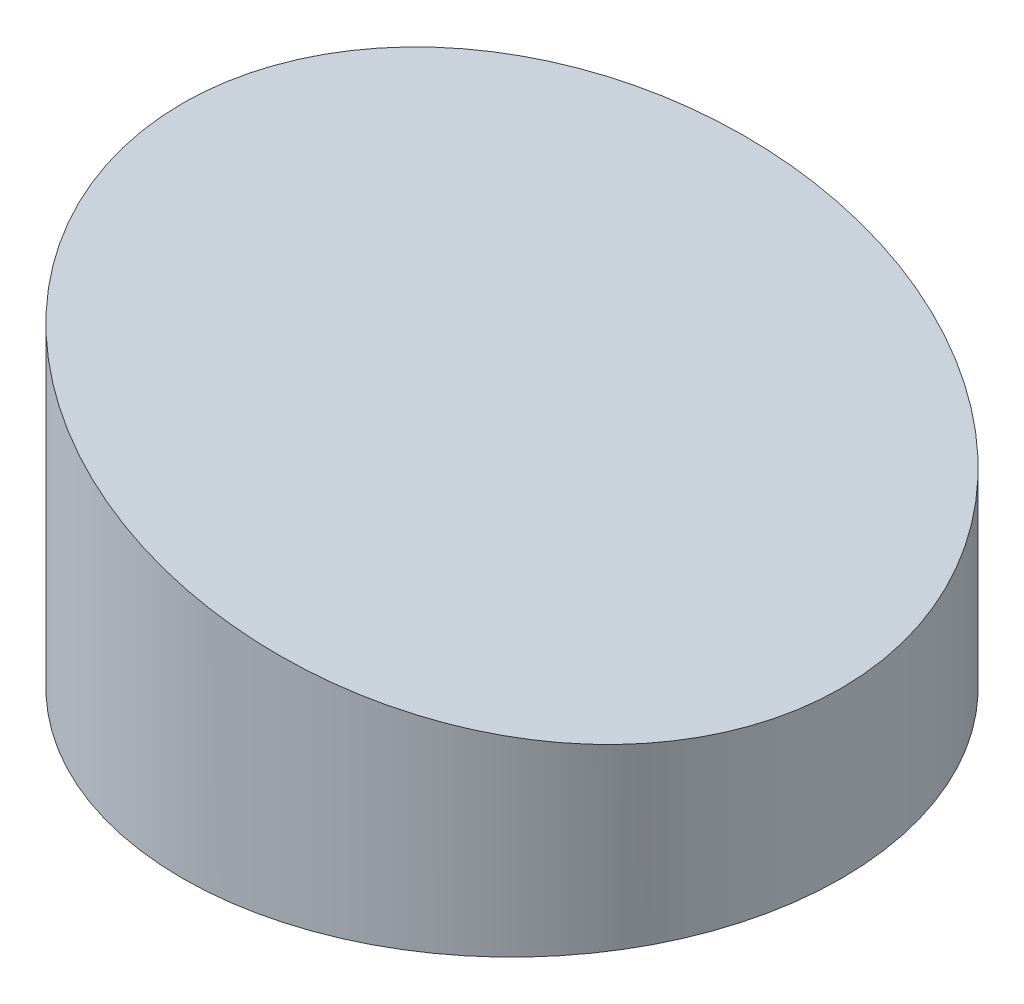
ISO-10303-21;
HEADER;
FILE_DESCRIPTION(('STEP AP214'),'2;1');
FILE_NAME('part.step','',(''),(''),'','','');
FILE_SCHEMA(('AUTOMOTIVE_DESIGN { 1 0 10303 214 1 1 1 1 }'));
ENDSEC;
DATA;
#1=APPLICATION_CONTEXT('core data for automotive mechanical design processes');
#2=APPLICATION_PROTOCOL_DEFINITION('international standard','automotive_design',2000,#1);
#3=PRODUCT_CONTEXT('',#1,'mechanical');
#4=PRODUCT('Part','Part','',(#3));
#5=PRODUCT_RELATED_PRODUCT_CATEGORY('part','',(#4));
#6=PRODUCT_DEFINITION_FORMATION('','',#4);
#7=PRODUCT_DEFINITION_CONTEXT('part definition',#1,'design');
#8=PRODUCT_DEFINITION('design','',#6,#7);
#9=PRODUCT_DEFINITION_SHAPE('','',#8);
#10=(LENGTH_UNIT() NAMED_UNIT(*) SI_UNIT(.MILLI.,.METRE.));
#11=(NAMED_UNIT(*) PLANE_ANGLE_UNIT() SI_UNIT($,.RADIAN.));
#12=(NAMED_UNIT(*) SI_UNIT($,.STERADIAN.) SOLID_ANGLE_UNIT());
#13=UNCERTAINTY_MEASURE_WITH_UNIT(LENGTH_MEASURE(1.E-05),#10,'distance_accuracy_value','');
#14=(GEOMETRIC_REPRESENTATION_CONTEXT(3) GLOBAL_UNCERTAINTY_ASSIGNED_CONTEXT((#13)) GLOBAL_UNIT_ASSIGNED_CONTEXT((#10,
#11,#12)) REPRESENTATION_CONTEXT('',''));
#15=CARTESIAN_POINT('',(0.,0.,0.));
#16=DIRECTION('',(0.,0.,1.));
#17=DIRECTION('',(1.,0.,0.));
#18=AXIS2_PLACEMENT_3D('',#15,#16,#17);
#19=CARTESIAN_POINT('',(0.,13.16,0.));
#20=DIRECTION('',(0.,-1.,0.));
#21=DIRECTION('',(0.,0.,-1.));
#22=AXIS2_PLACEMENT_3D('',#19,#20,#21);
#23=CYLINDRICAL_SURFACE('',#22,12.7);
#24=CARTESIAN_POINT('',(0.,0.,0.));
#25=DIRECTION('',(0.,1.,0.));
#26=DIRECTION('',(0.,0.,1.));
#27=AXIS2_PLACEMENT_3D('',#24,#25,#26);
#28=CIRCLE('',#27,12.7);
#29=CARTESIAN_POINT('',(0.,0.,12.7));
#30=VERTEX_POINT('',#29);
#31=EDGE_CURVE('E10',#30,#30,#28,.T.);
#32=ORIENTED_EDGE('',*,*,#31,.T.);
#33=EDGE_LOOP('',(#32));
#34=FACE_BOUND('',#33,.T.);
#35=CARTESIAN_POINT('',(0.,9.755,0.));
#36=DIRECTION('',(0.258964172391732,0.965886927863435,0.));
#37=DIRECTION('',(0.965886927863435,-0.258964172391732,0.));
#38=AXIS2_PLACEMENT_3D('',#35,#36,#37);
#39=ELLIPSE('',#38,13.1485369908595,12.7);
#40=CARTESIAN_POINT('',(12.7,6.35,0.));
#41=VERTEX_POINT('',#40);
#42=EDGE_CURVE('E40',#41,#41,#39,.T.);
#43=ORIENTED_EDGE('',*,*,#42,.F.);
#44=EDGE_LOOP('',(#43));
#45=FACE_BOUND('',#44,.T.);
#46=ADVANCED_FACE('F34',(#34,#45),#23,.T.);
#47=CARTESIAN_POINT('',(0.,0.,0.));
#48=DIRECTION('',(0.,1.,0.));
#49=DIRECTION('',(0.,0.,1.));
#50=AXIS2_PLACEMENT_3D('',#47,#48,#49);
#51=PLANE('',#50);
#52=CARTESIAN_POINT('',(4.76249999999992,0.,8.24889197104682));
#53=DIRECTION('',(0.,1.,0.));
#54=DIRECTION('',(0.,0.,1.));
#55=AXIS2_PLACEMENT_3D('',#52,#53,#54);
#56=CIRCLE('',#55,1.595);
#57=CARTESIAN_POINT('',(4.76249999999992,0.,9.84389197104682));
#58=VERTEX_POINT('',#57);
#59=EDGE_CURVE('E48',#58,#58,#56,.T.);
#60=ORIENTED_EDGE('',*,*,#59,.T.);
#61=EDGE_LOOP('',(#60));
#62=FACE_BOUND('',#61,.T.);
#63=CARTESIAN_POINT('',(9.535,0.,0.));
#64=DIRECTION('',(0.,1.,0.));
#65=DIRECTION('',(0.,0.,1.));
#66=AXIS2_PLACEMENT_3D('',#63,#64,#65);
#67=CIRCLE('',#66,1.595);
#68=CARTESIAN_POINT('',(9.535,0.,1.595));
#69=VERTEX_POINT('',#68);
#70=EDGE_CURVE('E72',#69,#69,#67,.T.);
#71=ORIENTED_EDGE('',*,*,#70,.T.);
#72=EDGE_LOOP('',(#71));
#73=FACE_BOUND('',#72,.T.);
#74=CARTESIAN_POINT('',(4.76250000000004,0.,-8.24889197104676));
#75=DIRECTION('',(0.,1.,0.));
#76=DIRECTION('',(0.,0.,1.));
#77=AXIS2_PLACEMENT_3D('',#74,#75,#76);
#78=CIRCLE('',#77,1.595);
#79=CARTESIAN_POINT('',(4.76250000000004,0.,-6.65389197104676));
#80=VERTEX_POINT('',#79);
#81=EDGE_CURVE('E66',#80,#80,#78,.T.);
#82=ORIENTED_EDGE('',*,*,#81,.T.);
#83=EDGE_LOOP('',(#82));
#84=FACE_BOUND('',#83,.T.);
#85=CARTESIAN_POINT('',(0.00499999999999806,0.,0.));
#86=DIRECTION('',(0.,1.,0.));
#87=DIRECTION('',(0.,0.,1.));
#88=AXIS2_PLACEMENT_3D('',#85,#86,#87);
#89=CIRCLE('',#88,1.595);
#90=CARTESIAN_POINT('',(0.00499999999999806,0.,1.595));
#91=VERTEX_POINT('',#90);
#92=EDGE_CURVE('E60',#91,#91,#89,.T.);
#93=ORIENTED_EDGE('',*,*,#92,.T.);
#94=EDGE_LOOP('',(#93));
#95=FACE_BOUND('',#94,.T.);
#96=CARTESIAN_POINT('',(-9.525,0.,0.));
#97=DIRECTION('',(0.,1.,0.));
#98=DIRECTION('',(0.,0.,1.));
#99=AXIS2_PLACEMENT_3D('',#96,#97,#98);
#100=CIRCLE('',#99,1.595);
#101=CARTESIAN_POINT('',(-9.525,0.,1.595));
#102=VERTEX_POINT('',#101);
#103=EDGE_CURVE('E54',#102,#102,#100,.T.);
#104=ORIENTED_EDGE('',*,*,#103,.T.);
#105=EDGE_LOOP('',(#104));
#106=FACE_BOUND('',#105,.T.);
#107=ORIENTED_EDGE('',*,*,#31,.F.);
#108=EDGE_LOOP('',(#107));
#109=FACE_BOUND('',#108,.T.);
#110=ADVANCED_FACE('F78',(#62,#73,#84,#95,#106,#109),#51,.F.);
#111=CARTESIAN_POINT('',(-12.7,13.16,63.6947396479738));
#112=DIRECTION('',(0.258964172391732,0.965886927863435,0.));
#113=DIRECTION('',(-0.965886927863435,0.258964172391732,0.));
#114=AXIS2_PLACEMENT_3D('',#111,#112,#113);
#115=PLANE('',#114);
#116=ORIENTED_EDGE('',*,*,#42,.T.);
#117=EDGE_LOOP('',(#116));
#118=FACE_BOUND('',#117,.T.);
#119=ADVANCED_FACE('F101',(#118),#115,.T.);
#120=CARTESIAN_POINT('',(-9.525,4.32,0.));
#121=DIRECTION('',(0.,-1.,0.));
#122=DIRECTION('',(0.,0.,-1.));
#123=AXIS2_PLACEMENT_3D('',#120,#121,#122);
#124=CYLINDRICAL_SURFACE('',#123,1.595);
#125=CARTESIAN_POINT('',(-9.525,4.32,0.));
#126=DIRECTION('',(0.,1.,0.));
#127=DIRECTION('',(0.,0.,1.));
#128=AXIS2_PLACEMENT_3D('',#125,#126,#127);
#129=CIRCLE('',#128,1.595);
#130=CARTESIAN_POINT('',(-9.525,4.32,1.595));
#131=VERTEX_POINT('',#130);
#132=EDGE_CURVE('E51',#131,#131,#129,.T.);
#133=ORIENTED_EDGE('',*,*,#132,.T.);
#134=EDGE_LOOP('',(#133));
#135=FACE_BOUND('',#134,.T.);
#136=ORIENTED_EDGE('',*,*,#103,.F.);
#137=EDGE_LOOP('',(#136));
#138=FACE_BOUND('',#137,.T.);
#139=ADVANCED_FACE('F106',(#135,#138),#124,.F.);
#140=CARTESIAN_POINT('',(-9.525,4.32,0.));
#141=DIRECTION('',(0.,1.,0.));
#142=DIRECTION('',(0.,0.,1.));
#143=AXIS2_PLACEMENT_3D('',#140,#141,#142);
#144=PLANE('',#143);
#145=ORIENTED_EDGE('',*,*,#132,.F.);
#146=EDGE_LOOP('',(#145));
#147=FACE_BOUND('',#146,.T.);
#148=ADVANCED_FACE('F109',(#147),#144,.F.);
#149=CARTESIAN_POINT('',(0.00499999999999806,4.32,0.));
#150=DIRECTION('',(0.,-1.,0.));
#151=DIRECTION('',(0.,0.,-1.));
#152=AXIS2_PLACEMENT_3D('',#149,#150,#151);
#153=CYLINDRICAL_SURFACE('',#152,1.595);
#154=CARTESIAN_POINT('',(0.00499999999999806,4.32,0.));
#155=DIRECTION('',(0.,1.,0.));
#156=DIRECTION('',(0.,0.,1.));
#157=AXIS2_PLACEMENT_3D('',#154,#155,#156);
#158=CIRCLE('',#157,1.595);
#159=CARTESIAN_POINT('',(0.00499999999999806,4.32,1.595));
#160=VERTEX_POINT('',#159);
#161=EDGE_CURVE('E57',#160,#160,#158,.T.);
#162=ORIENTED_EDGE('',*,*,#161,.T.);
#163=EDGE_LOOP('',(#162));
#164=FACE_BOUND('',#163,.T.);
#165=ORIENTED_EDGE('',*,*,#92,.F.);
#166=EDGE_LOOP('',(#165));
#167=FACE_BOUND('',#166,.T.);
#168=ADVANCED_FACE('F112',(#164,#167),#153,.F.);
#169=CARTESIAN_POINT('',(0.00499999999999806,4.32,0.));
#170=DIRECTION('',(0.,1.,0.));
#171=DIRECTION('',(0.,0.,1.));
#172=AXIS2_PLACEMENT_3D('',#169,#170,#171);
#173=PLANE('',#172);
#174=ORIENTED_EDGE('',*,*,#161,.F.);
#175=EDGE_LOOP('',(#174));
#176=FACE_BOUND('',#175,.T.);
#177=ADVANCED_FACE('F117',(#176),#173,.F.);
#178=CARTESIAN_POINT('',(4.76250000000004,4.32,-8.24889197104676));
#179=DIRECTION('',(0.,-1.,0.));
#180=DIRECTION('',(0.,0.,-1.));
#181=AXIS2_PLACEMENT_3D('',#178,#179,#180);
#182=CYLINDRICAL_SURFACE('',#181,1.595);
#183=CARTESIAN_POINT('',(4.76250000000004,4.32,-8.24889197104676));
#184=DIRECTION('',(0.,1.,0.));
#185=DIRECTION('',(0.,0.,1.));
#186=AXIS2_PLACEMENT_3D('',#183,#184,#185);
#187=CIRCLE('',#186,1.595);
#188=CARTESIAN_POINT('',(4.76250000000004,4.32,-6.65389197104676));
#189=VERTEX_POINT('',#188);
#190=EDGE_CURVE('E63',#189,#189,#187,.T.);
#191=ORIENTED_EDGE('',*,*,#190,.T.);
#192=EDGE_LOOP('',(#191));
#193=FACE_BOUND('',#192,.T.);
#194=ORIENTED_EDGE('',*,*,#81,.F.);
#195=EDGE_LOOP('',(#194));
#196=FACE_BOUND('',#195,.T.);
#197=ADVANCED_FACE('F120',(#193,#196),#182,.F.);
#198=CARTESIAN_POINT('',(4.76250000000004,4.32,-8.24889197104676));
#199=DIRECTION('',(0.,1.,0.));
#200=DIRECTION('',(0.,0.,1.));
#201=AXIS2_PLACEMENT_3D('',#198,#199,#200);
#202=PLANE('',#201);
#203=ORIENTED_EDGE('',*,*,#190,.F.);
#204=EDGE_LOOP('',(#203));
#205=FACE_BOUND('',#204,.T.);
#206=ADVANCED_FACE('F125',(#205),#202,.F.);
#207=CARTESIAN_POINT('',(9.535,4.32,0.));
#208=DIRECTION('',(0.,-1.,0.));
#209=DIRECTION('',(0.,0.,-1.));
#210=AXIS2_PLACEMENT_3D('',#207,#208,#209);
#211=CYLINDRICAL_SURFACE('',#210,1.595);
#212=CARTESIAN_POINT('',(9.535,4.32,0.));
#213=DIRECTION('',(0.,1.,0.));
#214=DIRECTION('',(0.,0.,1.));
#215=AXIS2_PLACEMENT_3D('',#212,#213,#214);
#216=CIRCLE('',#215,1.595);
#217=CARTESIAN_POINT('',(9.535,4.32,1.595));
#218=VERTEX_POINT('',#217);
#219=EDGE_CURVE('E69',#218,#218,#216,.T.);
#220=ORIENTED_EDGE('',*,*,#219,.T.);
#221=EDGE_LOOP('',(#220));
#222=FACE_BOUND('',#221,.T.);
#223=ORIENTED_EDGE('',*,*,#70,.F.);
#224=EDGE_LOOP('',(#223));
#225=FACE_BOUND('',#224,.T.);
#226=ADVANCED_FACE('F93',(#222,#225),#211,.F.);
#227=CARTESIAN_POINT('',(9.535,4.32,0.));
#228=DIRECTION('',(0.,1.,0.));
#229=DIRECTION('',(0.,0.,1.));
#230=AXIS2_PLACEMENT_3D('',#227,#228,#229);
#231=PLANE('',#230);
#232=ORIENTED_EDGE('',*,*,#219,.F.);
#233=EDGE_LOOP('',(#232));
#234=FACE_BOUND('',#233,.T.);
#235=ADVANCED_FACE('F84',(#234),#231,.F.);
#236=CARTESIAN_POINT('',(4.76249999999992,4.32,8.24889197104682));
#237=DIRECTION('',(0.,-1.,0.));
#238=DIRECTION('',(0.,0.,-1.));
#239=AXIS2_PLACEMENT_3D('',#236,#237,#238);
#240=CYLINDRICAL_SURFACE('',#239,1.595);
#241=CARTESIAN_POINT('',(4.76249999999992,4.32,8.24889197104682));
#242=DIRECTION('',(0.,1.,0.));
#243=DIRECTION('',(0.,0.,1.));
#244=AXIS2_PLACEMENT_3D('',#241,#242,#243);
#245=CIRCLE('',#244,1.595);
#246=CARTESIAN_POINT('',(4.76249999999992,4.32,9.84389197104682));
#247=VERTEX_POINT('',#246);
#248=EDGE_CURVE('E44',#247,#247,#245,.T.);
#249=ORIENTED_EDGE('',*,*,#248,.T.);
#250=EDGE_LOOP('',(#249));
#251=FACE_BOUND('',#250,.T.);
#252=ORIENTED_EDGE('',*,*,#59,.F.);
#253=EDGE_LOOP('',(#252));
#254=FACE_BOUND('',#253,.T.);
#255=ADVANCED_FACE('F81',(#251,#254),#240,.F.);
#256=CARTESIAN_POINT('',(4.76249999999992,4.32,8.24889197104682));
#257=DIRECTION('',(0.,1.,0.));
#258=DIRECTION('',(0.,0.,1.));
#259=AXIS2_PLACEMENT_3D('',#256,#257,#258);
#260=PLANE('',#259);
#261=ORIENTED_EDGE('',*,*,#248,.F.);
#262=EDGE_LOOP('',(#261));
#263=FACE_BOUND('',#262,.T.);
#264=ADVANCED_FACE('F83',(#263),#260,.F.);
#265=CLOSED_SHELL('',(#46,#110,#119,#139,#148,#168,#177,#197,#206,#226,#235,#255,#264));
#266=MANIFOLD_SOLID_BREP('B2',#265);
#267=ADVANCED_BREP_SHAPE_REPRESENTATION('',(#18,#266),#14);
#268=SHAPE_DEFINITION_REPRESENTATION(#9,#267);
ENDSEC;
END-ISO-10303-21;
